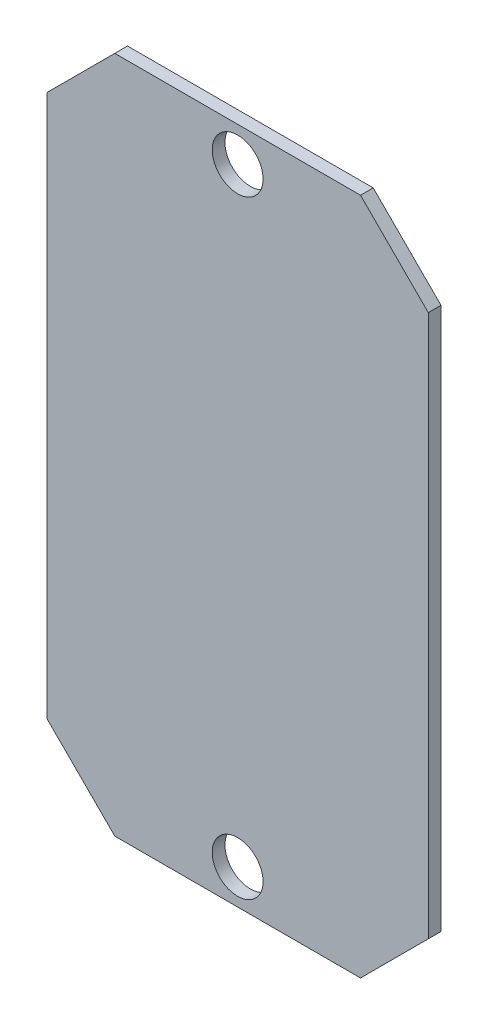
ISO-10303-21;
HEADER;
FILE_DESCRIPTION(('STEP AP214'),'2;1');
FILE_NAME('part.step','',(''),(''),'','','');
FILE_SCHEMA(('AUTOMOTIVE_DESIGN { 1 0 10303 214 1 1 1 1 }'));
ENDSEC;
DATA;
#1=APPLICATION_CONTEXT('core data for automotive mechanical design processes');
#2=APPLICATION_PROTOCOL_DEFINITION('international standard','automotive_design',2000,#1);
#3=PRODUCT_CONTEXT('',#1,'mechanical');
#4=PRODUCT('Part','Part','',(#3));
#5=PRODUCT_RELATED_PRODUCT_CATEGORY('part','',(#4));
#6=PRODUCT_DEFINITION_FORMATION('','',#4);
#7=PRODUCT_DEFINITION_CONTEXT('part definition',#1,'design');
#8=PRODUCT_DEFINITION('design','',#6,#7);
#9=PRODUCT_DEFINITION_SHAPE('','',#8);
#10=(LENGTH_UNIT() NAMED_UNIT(*) SI_UNIT(.MILLI.,.METRE.));
#11=(NAMED_UNIT(*) PLANE_ANGLE_UNIT() SI_UNIT($,.RADIAN.));
#12=(NAMED_UNIT(*) SI_UNIT($,.STERADIAN.) SOLID_ANGLE_UNIT());
#13=UNCERTAINTY_MEASURE_WITH_UNIT(LENGTH_MEASURE(1.E-05),#10,'distance_accuracy_value','');
#14=(GEOMETRIC_REPRESENTATION_CONTEXT(3) GLOBAL_UNCERTAINTY_ASSIGNED_CONTEXT((#13)) GLOBAL_UNIT_ASSIGNED_CONTEXT((#10,
#11,#12)) REPRESENTATION_CONTEXT('',''));
#15=CARTESIAN_POINT('',(0.,0.,0.));
#16=DIRECTION('',(0.,0.,1.));
#17=DIRECTION('',(1.,0.,0.));
#18=AXIS2_PLACEMENT_3D('',#15,#16,#17);
#19=CARTESIAN_POINT('',(0.,0.,1.5));
#20=DIRECTION('',(1.,0.,0.));
#21=DIRECTION('',(0.,0.,-1.));
#22=AXIS2_PLACEMENT_3D('',#19,#20,#21);
#23=PLANE('',#22);
#24=DIRECTION('',(0.,-1.,0.));
#25=VECTOR('',#24,1.);
#26=CARTESIAN_POINT('',(0.,0.,0.));
#27=LINE('',#26,#25);
#28=CARTESIAN_POINT('',(0.,72.,0.));
#29=VERTEX_POINT('',#28);
#30=CARTESIAN_POINT('',(0.,8.00000000000004,0.));
#31=VERTEX_POINT('',#30);
#32=EDGE_CURVE('E131',#29,#31,#27,.T.);
#33=ORIENTED_EDGE('',*,*,#32,.T.);
#34=DIRECTION('',(0.,0.,1.));
#35=VECTOR('',#34,1.);
#36=CARTESIAN_POINT('',(0.,8.00000000000004,1.5));
#37=LINE('',#36,#35);
#38=CARTESIAN_POINT('',(0.,8.00000000000004,1.5));
#39=VERTEX_POINT('',#38);
#40=EDGE_CURVE('E154',#31,#39,#37,.T.);
#41=ORIENTED_EDGE('',*,*,#40,.T.);
#42=DIRECTION('',(0.,-1.,0.));
#43=VECTOR('',#42,1.);
#44=CARTESIAN_POINT('',(0.,0.,1.5));
#45=LINE('',#44,#43);
#46=CARTESIAN_POINT('',(0.,72.,1.5));
#47=VERTEX_POINT('',#46);
#48=EDGE_CURVE('E129',#47,#39,#45,.T.);
#49=ORIENTED_EDGE('',*,*,#48,.F.);
#50=DIRECTION('',(0.,0.,-1.));
#51=VECTOR('',#50,1.);
#52=CARTESIAN_POINT('',(0.,72.,1.5));
#53=LINE('',#52,#51);
#54=EDGE_CURVE('E151',#47,#29,#53,.T.);
#55=ORIENTED_EDGE('',*,*,#54,.T.);
#56=EDGE_LOOP('',(#33,#41,#49,#55));
#57=FACE_BOUND('',#56,.T.);
#58=ADVANCED_FACE('F36',(#57),#23,.F.);
#59=CARTESIAN_POINT('',(0.,0.,1.5));
#60=DIRECTION('',(0.,1.,0.));
#61=DIRECTION('',(0.,0.,1.));
#62=AXIS2_PLACEMENT_3D('',#59,#60,#61);
#63=PLANE('',#62);
#64=DIRECTION('',(1.,0.,0.));
#65=VECTOR('',#64,1.);
#66=CARTESIAN_POINT('',(0.,0.,0.));
#67=LINE('',#66,#65);
#68=CARTESIAN_POINT('',(8.,0.,0.));
#69=VERTEX_POINT('',#68);
#70=CARTESIAN_POINT('',(37.,0.,0.));
#71=VERTEX_POINT('',#70);
#72=EDGE_CURVE('E127',#69,#71,#67,.T.);
#73=ORIENTED_EDGE('',*,*,#72,.T.);
#74=DIRECTION('',(0.,0.,1.));
#75=VECTOR('',#74,1.);
#76=CARTESIAN_POINT('',(37.,0.,1.5));
#77=LINE('',#76,#75);
#78=CARTESIAN_POINT('',(37.,0.,1.5));
#79=VERTEX_POINT('',#78);
#80=EDGE_CURVE('E106',#71,#79,#77,.T.);
#81=ORIENTED_EDGE('',*,*,#80,.T.);
#82=DIRECTION('',(1.,0.,0.));
#83=VECTOR('',#82,1.);
#84=CARTESIAN_POINT('',(0.,0.,1.5));
#85=LINE('',#84,#83);
#86=CARTESIAN_POINT('',(8.,0.,1.5));
#87=VERTEX_POINT('',#86);
#88=EDGE_CURVE('E170',#87,#79,#85,.T.);
#89=ORIENTED_EDGE('',*,*,#88,.F.);
#90=DIRECTION('',(0.,0.,-1.));
#91=VECTOR('',#90,1.);
#92=CARTESIAN_POINT('',(8.00000000000001,0.,1.5));
#93=LINE('',#92,#91);
#94=EDGE_CURVE('E111',#87,#69,#93,.T.);
#95=ORIENTED_EDGE('',*,*,#94,.T.);
#96=EDGE_LOOP('',(#73,#81,#89,#95));
#97=FACE_BOUND('',#96,.T.);
#98=ADVANCED_FACE('F203',(#97),#63,.F.);
#99=CARTESIAN_POINT('',(45.,0.,1.5));
#100=DIRECTION('',(-1.,0.,0.));
#101=DIRECTION('',(0.,0.,1.));
#102=AXIS2_PLACEMENT_3D('',#99,#100,#101);
#103=PLANE('',#102);
#104=DIRECTION('',(0.,1.,0.));
#105=VECTOR('',#104,1.);
#106=CARTESIAN_POINT('',(45.,0.,1.5));
#107=LINE('',#106,#105);
#108=CARTESIAN_POINT('',(45.,8.00000000000001,1.5));
#109=VERTEX_POINT('',#108);
#110=CARTESIAN_POINT('',(45.,72.,1.5));
#111=VERTEX_POINT('',#110);
#112=EDGE_CURVE('E120',#109,#111,#107,.T.);
#113=ORIENTED_EDGE('',*,*,#112,.F.);
#114=DIRECTION('',(0.,0.,-1.));
#115=VECTOR('',#114,1.);
#116=CARTESIAN_POINT('',(45.,8.00000000000001,1.5));
#117=LINE('',#116,#115);
#118=CARTESIAN_POINT('',(45.,8.00000000000001,0.));
#119=VERTEX_POINT('',#118);
#120=EDGE_CURVE('E105',#109,#119,#117,.T.);
#121=ORIENTED_EDGE('',*,*,#120,.T.);
#122=DIRECTION('',(0.,1.,0.));
#123=VECTOR('',#122,1.);
#124=CARTESIAN_POINT('',(45.,0.,0.));
#125=LINE('',#124,#123);
#126=CARTESIAN_POINT('',(45.,72.,0.));
#127=VERTEX_POINT('',#126);
#128=EDGE_CURVE('E118',#119,#127,#125,.T.);
#129=ORIENTED_EDGE('',*,*,#128,.T.);
#130=DIRECTION('',(0.,0.,1.));
#131=VECTOR('',#130,1.);
#132=CARTESIAN_POINT('',(45.,72.,1.5));
#133=LINE('',#132,#131);
#134=EDGE_CURVE('E122',#127,#111,#133,.T.);
#135=ORIENTED_EDGE('',*,*,#134,.T.);
#136=EDGE_LOOP('',(#113,#121,#129,#135));
#137=FACE_BOUND('',#136,.T.);
#138=ADVANCED_FACE('F117',(#137),#103,.F.);
#139=CARTESIAN_POINT('',(0.,80.,1.5));
#140=DIRECTION('',(0.,-1.,0.));
#141=DIRECTION('',(0.,0.,-1.));
#142=AXIS2_PLACEMENT_3D('',#139,#140,#141);
#143=PLANE('',#142);
#144=DIRECTION('',(-1.,0.,0.));
#145=VECTOR('',#144,1.);
#146=CARTESIAN_POINT('',(0.,80.,0.));
#147=LINE('',#146,#145);
#148=CARTESIAN_POINT('',(37.,80.,0.));
#149=VERTEX_POINT('',#148);
#150=CARTESIAN_POINT('',(8.,80.,0.));
#151=VERTEX_POINT('',#150);
#152=EDGE_CURVE('E126',#149,#151,#147,.T.);
#153=ORIENTED_EDGE('',*,*,#152,.T.);
#154=DIRECTION('',(0.,0.,1.));
#155=VECTOR('',#154,1.);
#156=CARTESIAN_POINT('',(8.00000000000001,80.,1.5));
#157=LINE('',#156,#155);
#158=CARTESIAN_POINT('',(8.,80.,1.5));
#159=VERTEX_POINT('',#158);
#160=EDGE_CURVE('E11',#151,#159,#157,.T.);
#161=ORIENTED_EDGE('',*,*,#160,.T.);
#162=DIRECTION('',(-1.,0.,0.));
#163=VECTOR('',#162,1.);
#164=CARTESIAN_POINT('',(0.,80.,1.5));
#165=LINE('',#164,#163);
#166=CARTESIAN_POINT('',(37.,80.,1.5));
#167=VERTEX_POINT('',#166);
#168=EDGE_CURVE('E135',#167,#159,#165,.T.);
#169=ORIENTED_EDGE('',*,*,#168,.F.);
#170=DIRECTION('',(0.,0.,-1.));
#171=VECTOR('',#170,1.);
#172=CARTESIAN_POINT('',(37.,80.,1.5));
#173=LINE('',#172,#171);
#174=EDGE_CURVE('E44',#167,#149,#173,.T.);
#175=ORIENTED_EDGE('',*,*,#174,.T.);
#176=EDGE_LOOP('',(#153,#161,#169,#175));
#177=FACE_BOUND('',#176,.T.);
#178=ADVANCED_FACE('F157',(#177),#143,.F.);
#179=CARTESIAN_POINT('',(0.,0.,1.5));
#180=DIRECTION('',(0.,0.,-1.));
#181=DIRECTION('',(-1.,0.,0.));
#182=AXIS2_PLACEMENT_3D('',#179,#180,#181);
#183=PLANE('',#182);
#184=CARTESIAN_POINT('',(22.5,75.9,1.5));
#185=DIRECTION('',(0.,0.,1.));
#186=DIRECTION('',(1.,0.,0.));
#187=AXIS2_PLACEMENT_3D('',#184,#185,#186);
#188=CIRCLE('',#187,3.);
#189=CARTESIAN_POINT('',(25.5,75.9,1.5));
#190=VERTEX_POINT('',#189);
#191=EDGE_CURVE('E181',#190,#190,#188,.T.);
#192=ORIENTED_EDGE('',*,*,#191,.F.);
#193=EDGE_LOOP('',(#192));
#194=FACE_BOUND('',#193,.T.);
#195=CARTESIAN_POINT('',(22.5,4.1,1.5));
#196=DIRECTION('',(0.,0.,1.));
#197=DIRECTION('',(1.,0.,0.));
#198=AXIS2_PLACEMENT_3D('',#195,#196,#197);
#199=CIRCLE('',#198,3.);
#200=CARTESIAN_POINT('',(25.5,4.1,1.5));
#201=VERTEX_POINT('',#200);
#202=EDGE_CURVE('E175',#201,#201,#199,.T.);
#203=ORIENTED_EDGE('',*,*,#202,.F.);
#204=EDGE_LOOP('',(#203));
#205=FACE_BOUND('',#204,.T.);
#206=ORIENTED_EDGE('',*,*,#88,.T.);
#207=DIRECTION('',(-0.707106781186549,-0.707106781186546,0.));
#208=VECTOR('',#207,1.);
#209=CARTESIAN_POINT('',(45.,8.00000000000001,1.5));
#210=LINE('',#209,#208);
#211=EDGE_CURVE('E149',#79,#109,#210,.F.);
#212=ORIENTED_EDGE('',*,*,#211,.T.);
#213=ORIENTED_EDGE('',*,*,#112,.T.);
#214=DIRECTION('',(0.707106781186546,-0.707106781186549,0.));
#215=VECTOR('',#214,1.);
#216=CARTESIAN_POINT('',(37.,80.,1.5));
#217=LINE('',#216,#215);
#218=EDGE_CURVE('E56',#111,#167,#217,.F.);
#219=ORIENTED_EDGE('',*,*,#218,.T.);
#220=ORIENTED_EDGE('',*,*,#168,.T.);
#221=DIRECTION('',(0.707106781186546,0.707106781186549,0.));
#222=VECTOR('',#221,1.);
#223=CARTESIAN_POINT('',(0.,72.,1.5));
#224=LINE('',#223,#222);
#225=EDGE_CURVE('E145',#159,#47,#224,.F.);
#226=ORIENTED_EDGE('',*,*,#225,.T.);
#227=ORIENTED_EDGE('',*,*,#48,.T.);
#228=DIRECTION('',(-0.707106781186546,0.707106781186549,0.));
#229=VECTOR('',#228,1.);
#230=CARTESIAN_POINT('',(8.00000000000001,0.,1.5));
#231=LINE('',#230,#229);
#232=EDGE_CURVE('E147',#39,#87,#231,.F.);
#233=ORIENTED_EDGE('',*,*,#232,.T.);
#234=EDGE_LOOP('',(#206,#212,#213,#219,#220,#226,#227,#233));
#235=FACE_BOUND('',#234,.T.);
#236=ADVANCED_FACE('F196',(#194,#205,#235),#183,.F.);
#237=CARTESIAN_POINT('',(0.,0.,0.));
#238=DIRECTION('',(0.,0.,-1.));
#239=DIRECTION('',(-1.,0.,0.));
#240=AXIS2_PLACEMENT_3D('',#237,#238,#239);
#241=PLANE('',#240);
#242=CARTESIAN_POINT('',(22.5,75.9,0.));
#243=DIRECTION('',(0.,0.,1.));
#244=DIRECTION('',(1.,0.,0.));
#245=AXIS2_PLACEMENT_3D('',#242,#243,#244);
#246=CIRCLE('',#245,3.);
#247=CARTESIAN_POINT('',(25.5,75.9,0.));
#248=VERTEX_POINT('',#247);
#249=EDGE_CURVE('E179',#248,#248,#246,.T.);
#250=ORIENTED_EDGE('',*,*,#249,.T.);
#251=EDGE_LOOP('',(#250));
#252=FACE_BOUND('',#251,.T.);
#253=CARTESIAN_POINT('',(22.5,4.1,0.));
#254=DIRECTION('',(0.,0.,1.));
#255=DIRECTION('',(1.,0.,0.));
#256=AXIS2_PLACEMENT_3D('',#253,#254,#255);
#257=CIRCLE('',#256,3.);
#258=CARTESIAN_POINT('',(25.5,4.1,0.));
#259=VERTEX_POINT('',#258);
#260=EDGE_CURVE('E186',#259,#259,#257,.T.);
#261=ORIENTED_EDGE('',*,*,#260,.T.);
#262=EDGE_LOOP('',(#261));
#263=FACE_BOUND('',#262,.T.);
#264=ORIENTED_EDGE('',*,*,#128,.F.);
#265=DIRECTION('',(0.707106781186549,0.707106781186546,0.));
#266=VECTOR('',#265,1.);
#267=CARTESIAN_POINT('',(18.4999999999999,-18.5,0.));
#268=LINE('',#267,#266);
#269=EDGE_CURVE('E101',#119,#71,#268,.F.);
#270=ORIENTED_EDGE('',*,*,#269,.T.);
#271=ORIENTED_EDGE('',*,*,#72,.F.);
#272=DIRECTION('',(0.707106781186546,-0.707106781186549,0.));
#273=VECTOR('',#272,1.);
#274=CARTESIAN_POINT('',(4.00000000000002,4.,0.));
#275=LINE('',#274,#273);
#276=EDGE_CURVE('E112',#69,#31,#275,.F.);
#277=ORIENTED_EDGE('',*,*,#276,.T.);
#278=ORIENTED_EDGE('',*,*,#32,.F.);
#279=DIRECTION('',(-0.707106781186546,-0.707106781186549,0.));
#280=VECTOR('',#279,1.);
#281=CARTESIAN_POINT('',(-36.,35.9999999999999,0.));
#282=LINE('',#281,#280);
#283=EDGE_CURVE('E138',#29,#151,#282,.F.);
#284=ORIENTED_EDGE('',*,*,#283,.T.);
#285=ORIENTED_EDGE('',*,*,#152,.F.);
#286=DIRECTION('',(-0.707106781186546,0.707106781186549,0.));
#287=VECTOR('',#286,1.);
#288=CARTESIAN_POINT('',(58.5000000000001,58.4999999999999,0.));
#289=LINE('',#288,#287);
#290=EDGE_CURVE('E121',#149,#127,#289,.F.);
#291=ORIENTED_EDGE('',*,*,#290,.T.);
#292=EDGE_LOOP('',(#264,#270,#271,#277,#278,#284,#285,#291));
#293=FACE_BOUND('',#292,.T.);
#294=ADVANCED_FACE('F124',(#252,#263,#293),#241,.T.);
#295=CARTESIAN_POINT('',(45.,8.00000000000001,1.5));
#296=DIRECTION('',(-0.707106781186546,0.707106781186549,0.));
#297=DIRECTION('',(0.,0.,-1.));
#298=AXIS2_PLACEMENT_3D('',#295,#296,#297);
#299=PLANE('',#298);
#300=ORIENTED_EDGE('',*,*,#211,.F.);
#301=ORIENTED_EDGE('',*,*,#80,.F.);
#302=ORIENTED_EDGE('',*,*,#269,.F.);
#303=ORIENTED_EDGE('',*,*,#120,.F.);
#304=EDGE_LOOP('',(#300,#301,#302,#303));
#305=FACE_BOUND('',#304,.T.);
#306=ADVANCED_FACE('F104',(#305),#299,.F.);
#307=CARTESIAN_POINT('',(8.00000000000001,0.,1.5));
#308=DIRECTION('',(0.707106781186549,0.707106781186546,0.));
#309=DIRECTION('',(0.,0.,-1.));
#310=AXIS2_PLACEMENT_3D('',#307,#308,#309);
#311=PLANE('',#310);
#312=ORIENTED_EDGE('',*,*,#232,.F.);
#313=ORIENTED_EDGE('',*,*,#40,.F.);
#314=ORIENTED_EDGE('',*,*,#276,.F.);
#315=ORIENTED_EDGE('',*,*,#94,.F.);
#316=EDGE_LOOP('',(#312,#313,#314,#315));
#317=FACE_BOUND('',#316,.T.);
#318=ADVANCED_FACE('F205',(#317),#311,.F.);
#319=CARTESIAN_POINT('',(0.,72.,1.5));
#320=DIRECTION('',(0.707106781186549,-0.707106781186546,0.));
#321=DIRECTION('',(0.,0.,-1.));
#322=AXIS2_PLACEMENT_3D('',#319,#320,#321);
#323=PLANE('',#322);
#324=ORIENTED_EDGE('',*,*,#225,.F.);
#325=ORIENTED_EDGE('',*,*,#160,.F.);
#326=ORIENTED_EDGE('',*,*,#283,.F.);
#327=ORIENTED_EDGE('',*,*,#54,.F.);
#328=EDGE_LOOP('',(#324,#325,#326,#327));
#329=FACE_BOUND('',#328,.T.);
#330=ADVANCED_FACE('F164',(#329),#323,.F.);
#331=CARTESIAN_POINT('',(37.,80.,1.5));
#332=DIRECTION('',(-0.707106781186549,-0.707106781186546,0.));
#333=DIRECTION('',(0.,0.,-1.));
#334=AXIS2_PLACEMENT_3D('',#331,#332,#333);
#335=PLANE('',#334);
#336=ORIENTED_EDGE('',*,*,#218,.F.);
#337=ORIENTED_EDGE('',*,*,#134,.F.);
#338=ORIENTED_EDGE('',*,*,#290,.F.);
#339=ORIENTED_EDGE('',*,*,#174,.F.);
#340=EDGE_LOOP('',(#336,#337,#338,#339));
#341=FACE_BOUND('',#340,.T.);
#342=ADVANCED_FACE('F38',(#341),#335,.F.);
#343=CARTESIAN_POINT('',(22.5,4.1,0.));
#344=DIRECTION('',(0.,0.,1.));
#345=DIRECTION('',(1.,0.,0.));
#346=AXIS2_PLACEMENT_3D('',#343,#344,#345);
#347=CYLINDRICAL_SURFACE('',#346,3.);
#348=ORIENTED_EDGE('',*,*,#260,.F.);
#349=EDGE_LOOP('',(#348));
#350=FACE_BOUND('',#349,.T.);
#351=ORIENTED_EDGE('',*,*,#202,.T.);
#352=EDGE_LOOP('',(#351));
#353=FACE_BOUND('',#352,.T.);
#354=ADVANCED_FACE('F194',(#350,#353),#347,.F.);
#355=CARTESIAN_POINT('',(22.5,75.9,0.));
#356=DIRECTION('',(0.,0.,1.));
#357=DIRECTION('',(1.,0.,0.));
#358=AXIS2_PLACEMENT_3D('',#355,#356,#357);
#359=CYLINDRICAL_SURFACE('',#358,3.);
#360=ORIENTED_EDGE('',*,*,#249,.F.);
#361=EDGE_LOOP('',(#360));
#362=FACE_BOUND('',#361,.T.);
#363=ORIENTED_EDGE('',*,*,#191,.T.);
#364=EDGE_LOOP('',(#363));
#365=FACE_BOUND('',#364,.T.);
#366=ADVANCED_FACE('F228',(#362,#365),#359,.F.);
#367=CLOSED_SHELL('',(#58,#98,#138,#178,#236,#294,#306,#318,#330,#342,#354,#366));
#368=MANIFOLD_SOLID_BREP('B2',#367);
#369=ADVANCED_BREP_SHAPE_REPRESENTATION('',(#18,#368),#14);
#370=SHAPE_DEFINITION_REPRESENTATION(#9,#369);
ENDSEC;
END-ISO-10303-21;
